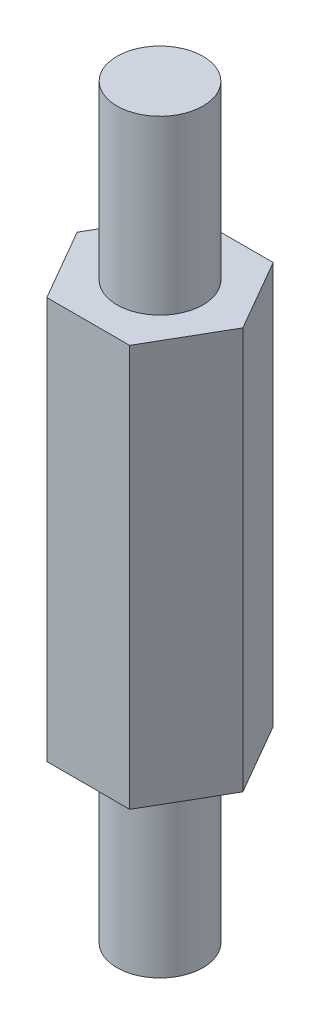
ISO-10303-21;
HEADER;
FILE_DESCRIPTION(('STEP AP214'),'2;1');
FILE_NAME('part.step','',(''),(''),'','','');
FILE_SCHEMA(('AUTOMOTIVE_DESIGN { 1 0 10303 214 1 1 1 1 }'));
ENDSEC;
DATA;
#1=APPLICATION_CONTEXT('core data for automotive mechanical design processes');
#2=APPLICATION_PROTOCOL_DEFINITION('international standard','automotive_design',2000,#1);
#3=PRODUCT_CONTEXT('',#1,'mechanical');
#4=PRODUCT('Part','Part','',(#3));
#5=PRODUCT_RELATED_PRODUCT_CATEGORY('part','',(#4));
#6=PRODUCT_DEFINITION_FORMATION('','',#4);
#7=PRODUCT_DEFINITION_CONTEXT('part definition',#1,'design');
#8=PRODUCT_DEFINITION('design','',#6,#7);
#9=PRODUCT_DEFINITION_SHAPE('','',#8);
#10=(LENGTH_UNIT() NAMED_UNIT(*) SI_UNIT(.MILLI.,.METRE.));
#11=(NAMED_UNIT(*) PLANE_ANGLE_UNIT() SI_UNIT($,.RADIAN.));
#12=(NAMED_UNIT(*) SI_UNIT($,.STERADIAN.) SOLID_ANGLE_UNIT());
#13=UNCERTAINTY_MEASURE_WITH_UNIT(LENGTH_MEASURE(1.E-05),#10,'distance_accuracy_value','');
#14=(GEOMETRIC_REPRESENTATION_CONTEXT(3) GLOBAL_UNCERTAINTY_ASSIGNED_CONTEXT((#13)) GLOBAL_UNIT_ASSIGNED_CONTEXT((#10,
#11,#12)) REPRESENTATION_CONTEXT('',''));
#15=CARTESIAN_POINT('',(0.,0.,0.));
#16=DIRECTION('',(0.,0.,1.));
#17=DIRECTION('',(1.,0.,0.));
#18=AXIS2_PLACEMENT_3D('',#15,#16,#17);
#19=CARTESIAN_POINT('',(0.,-6.,0.));
#20=DIRECTION('',(0.,-1.,0.));
#21=DIRECTION('',(1.,0.,0.));
#22=AXIS2_PLACEMENT_3D('',#19,#20,#21);
#23=PLANE('',#22);
#24=CARTESIAN_POINT('',(0.,-6.,0.));
#25=DIRECTION('',(0.,-1.,0.));
#26=DIRECTION('',(1.,0.,0.));
#27=AXIS2_PLACEMENT_3D('',#24,#25,#26);
#28=CIRCLE('',#27,1.5);
#29=CARTESIAN_POINT('',(1.5,-6.,0.));
#30=VERTEX_POINT('',#29);
#31=EDGE_CURVE('E19',#30,#30,#28,.F.);
#32=ORIENTED_EDGE('',*,*,#31,.F.);
#33=EDGE_LOOP('',(#32));
#34=FACE_BOUND('',#33,.T.);
#35=ADVANCED_FACE('F16',(#34),#23,.T.);
#36=CARTESIAN_POINT('',(0.,-3.,0.));
#37=DIRECTION('',(0.,-1.,0.));
#38=DIRECTION('',(1.,0.,0.));
#39=AXIS2_PLACEMENT_3D('',#36,#37,#38);
#40=CYLINDRICAL_SURFACE('',#39,1.5);
#41=CARTESIAN_POINT('',(0.,0.,0.));
#42=DIRECTION('',(0.,-1.,0.));
#43=DIRECTION('',(1.,0.,0.));
#44=AXIS2_PLACEMENT_3D('',#41,#42,#43);
#45=CIRCLE('',#44,1.5);
#46=CARTESIAN_POINT('',(1.5,0.,0.));
#47=VERTEX_POINT('',#46);
#48=EDGE_CURVE('E85',#47,#47,#45,.T.);
#49=ORIENTED_EDGE('',*,*,#48,.T.);
#50=EDGE_LOOP('',(#49));
#51=FACE_BOUND('',#50,.T.);
#52=ORIENTED_EDGE('',*,*,#31,.T.);
#53=EDGE_LOOP('',(#52));
#54=FACE_BOUND('',#53,.T.);
#55=ADVANCED_FACE('F104',(#51,#54),#40,.T.);
#56=CARTESIAN_POINT('',(0.,0.,0.));
#57=DIRECTION('',(0.,1.,0.));
#58=DIRECTION('',(0.,0.,1.));
#59=AXIS2_PLACEMENT_3D('',#56,#57,#58);
#60=PLANE('',#59);
#61=ORIENTED_EDGE('',*,*,#48,.F.);
#62=EDGE_LOOP('',(#61));
#63=FACE_BOUND('',#62,.T.);
#64=DIRECTION('',(-0.500000000000001,0.,-0.866025403784438));
#65=VECTOR('',#64,1.);
#66=CARTESIAN_POINT('',(2.88675134594813,0.,0.));
#67=LINE('',#66,#65);
#68=CARTESIAN_POINT('',(2.88675134594813,0.,0.));
#69=VERTEX_POINT('',#68);
#70=CARTESIAN_POINT('',(1.44337567297406,0.,-2.5));
#71=VERTEX_POINT('',#70);
#72=EDGE_CURVE('E242',#69,#71,#67,.T.);
#73=ORIENTED_EDGE('',*,*,#72,.F.);
#74=DIRECTION('',(0.499999999999999,0.,-0.866025403784439));
#75=VECTOR('',#74,1.);
#76=CARTESIAN_POINT('',(1.44337567297407,0.,2.5));
#77=LINE('',#76,#75);
#78=CARTESIAN_POINT('',(1.44337567297407,0.,2.5));
#79=VERTEX_POINT('',#78);
#80=EDGE_CURVE('E247',#79,#69,#77,.T.);
#81=ORIENTED_EDGE('',*,*,#80,.F.);
#82=DIRECTION('',(1.,0.,0.));
#83=VECTOR('',#82,1.);
#84=CARTESIAN_POINT('',(-1.44337567297406,0.,2.5));
#85=LINE('',#84,#83);
#86=CARTESIAN_POINT('',(-1.44337567297406,0.,2.5));
#87=VERTEX_POINT('',#86);
#88=EDGE_CURVE('E250',#87,#79,#85,.T.);
#89=ORIENTED_EDGE('',*,*,#88,.F.);
#90=DIRECTION('',(0.500000000000001,0.,0.866025403784438));
#91=VECTOR('',#90,1.);
#92=CARTESIAN_POINT('',(-2.88675134594813,0.,0.));
#93=LINE('',#92,#91);
#94=CARTESIAN_POINT('',(-2.88675134594813,0.,0.));
#95=VERTEX_POINT('',#94);
#96=EDGE_CURVE('E67',#95,#87,#93,.T.);
#97=ORIENTED_EDGE('',*,*,#96,.F.);
#98=DIRECTION('',(-0.5,0.,0.866025403784439));
#99=VECTOR('',#98,1.);
#100=CARTESIAN_POINT('',(-1.44337567297406,0.,-2.5));
#101=LINE('',#100,#99);
#102=CARTESIAN_POINT('',(-1.44337567297406,0.,-2.5));
#103=VERTEX_POINT('',#102);
#104=EDGE_CURVE('E69',#103,#95,#101,.T.);
#105=ORIENTED_EDGE('',*,*,#104,.F.);
#106=DIRECTION('',(-1.,0.,0.));
#107=VECTOR('',#106,1.);
#108=CARTESIAN_POINT('',(1.44337567297406,0.,-2.5));
#109=LINE('',#108,#107);
#110=EDGE_CURVE('E72',#71,#103,#109,.T.);
#111=ORIENTED_EDGE('',*,*,#110,.F.);
#112=EDGE_LOOP('',(#73,#81,#89,#97,#105,#111));
#113=FACE_BOUND('',#112,.T.);
#114=ADVANCED_FACE('F71',(#63,#113),#60,.F.);
#115=CARTESIAN_POINT('',(1.44337567297406,0.,-2.5));
#116=DIRECTION('',(0.,0.,-1.));
#117=DIRECTION('',(-1.,0.,0.));
#118=AXIS2_PLACEMENT_3D('',#115,#116,#117);
#119=PLANE('',#118);
#120=DIRECTION('',(1.,0.,0.));
#121=VECTOR('',#120,1.);
#122=CARTESIAN_POINT('',(0.,14.,-2.5));
#123=LINE('',#122,#121);
#124=CARTESIAN_POINT('',(1.44337567297406,14.,-2.5));
#125=VERTEX_POINT('',#124);
#126=CARTESIAN_POINT('',(-1.44337567297406,14.,-2.5));
#127=VERTEX_POINT('',#126);
#128=EDGE_CURVE('E235',#125,#127,#123,.F.);
#129=ORIENTED_EDGE('',*,*,#128,.F.);
#130=DIRECTION('',(0.,1.,0.));
#131=VECTOR('',#130,1.);
#132=CARTESIAN_POINT('',(1.44337567297406,0.,-2.5));
#133=LINE('',#132,#131);
#134=EDGE_CURVE('E83',#71,#125,#133,.T.);
#135=ORIENTED_EDGE('',*,*,#134,.F.);
#136=ORIENTED_EDGE('',*,*,#110,.T.);
#137=DIRECTION('',(0.,1.,0.));
#138=VECTOR('',#137,1.);
#139=CARTESIAN_POINT('',(-1.44337567297406,0.,-2.5));
#140=LINE('',#139,#138);
#141=EDGE_CURVE('E77',#127,#103,#140,.F.);
#142=ORIENTED_EDGE('',*,*,#141,.F.);
#143=EDGE_LOOP('',(#129,#135,#136,#142));
#144=FACE_BOUND('',#143,.T.);
#145=ADVANCED_FACE('F80',(#144),#119,.T.);
#146=CARTESIAN_POINT('',(-1.44337567297406,0.,-2.5));
#147=DIRECTION('',(-0.866025403784439,0.,-0.5));
#148=DIRECTION('',(-0.5,0.,0.866025403784439));
#149=AXIS2_PLACEMENT_3D('',#146,#147,#148);
#150=PLANE('',#149);
#151=DIRECTION('',(-0.500000000000001,0.,0.866025403784438));
#152=VECTOR('',#151,1.);
#153=CARTESIAN_POINT('',(-1.44337567297406,14.,-2.5));
#154=LINE('',#153,#152);
#155=CARTESIAN_POINT('',(-2.88675134594813,14.,0.));
#156=VERTEX_POINT('',#155);
#157=EDGE_CURVE('E89',#127,#156,#154,.T.);
#158=ORIENTED_EDGE('',*,*,#157,.F.);
#159=ORIENTED_EDGE('',*,*,#141,.T.);
#160=ORIENTED_EDGE('',*,*,#104,.T.);
#161=DIRECTION('',(0.,1.,0.));
#162=VECTOR('',#161,1.);
#163=CARTESIAN_POINT('',(-2.88675134594813,0.,0.));
#164=LINE('',#163,#162);
#165=EDGE_CURVE('E92',#156,#95,#164,.F.);
#166=ORIENTED_EDGE('',*,*,#165,.F.);
#167=EDGE_LOOP('',(#158,#159,#160,#166));
#168=FACE_BOUND('',#167,.T.);
#169=ADVANCED_FACE('F87',(#168),#150,.T.);
#170=CARTESIAN_POINT('',(-2.88675134594813,0.,0.));
#171=DIRECTION('',(-0.866025403784438,0.,0.500000000000001));
#172=DIRECTION('',(0.500000000000001,0.,0.866025403784438));
#173=AXIS2_PLACEMENT_3D('',#170,#171,#172);
#174=PLANE('',#173);
#175=DIRECTION('',(0.500000000000002,0.,0.866025403784438));
#176=VECTOR('',#175,1.);
#177=CARTESIAN_POINT('',(-2.88675134594813,14.,0.));
#178=LINE('',#177,#176);
#179=CARTESIAN_POINT('',(-1.44337567297406,14.,2.5));
#180=VERTEX_POINT('',#179);
#181=EDGE_CURVE('E225',#156,#180,#178,.T.);
#182=ORIENTED_EDGE('',*,*,#181,.F.);
#183=ORIENTED_EDGE('',*,*,#165,.T.);
#184=ORIENTED_EDGE('',*,*,#96,.T.);
#185=DIRECTION('',(0.,1.,0.));
#186=VECTOR('',#185,1.);
#187=CARTESIAN_POINT('',(-1.44337567297406,0.,2.5));
#188=LINE('',#187,#186);
#189=EDGE_CURVE('E227',#180,#87,#188,.F.);
#190=ORIENTED_EDGE('',*,*,#189,.F.);
#191=EDGE_LOOP('',(#182,#183,#184,#190));
#192=FACE_BOUND('',#191,.T.);
#193=ADVANCED_FACE('F137',(#192),#174,.T.);
#194=CARTESIAN_POINT('',(-1.44337567297406,0.,2.5));
#195=DIRECTION('',(0.,0.,1.));
#196=DIRECTION('',(1.,0.,0.));
#197=AXIS2_PLACEMENT_3D('',#194,#195,#196);
#198=PLANE('',#197);
#199=DIRECTION('',(1.,0.,0.));
#200=VECTOR('',#199,1.);
#201=CARTESIAN_POINT('',(0.,14.,2.5));
#202=LINE('',#201,#200);
#203=CARTESIAN_POINT('',(1.44337567297407,14.,2.5));
#204=VERTEX_POINT('',#203);
#205=EDGE_CURVE('E231',#180,#204,#202,.T.);
#206=ORIENTED_EDGE('',*,*,#205,.F.);
#207=ORIENTED_EDGE('',*,*,#189,.T.);
#208=ORIENTED_EDGE('',*,*,#88,.T.);
#209=DIRECTION('',(0.,1.,0.));
#210=VECTOR('',#209,1.);
#211=CARTESIAN_POINT('',(1.44337567297407,0.,2.5));
#212=LINE('',#211,#210);
#213=EDGE_CURVE('E244',#204,#79,#212,.F.);
#214=ORIENTED_EDGE('',*,*,#213,.F.);
#215=EDGE_LOOP('',(#206,#207,#208,#214));
#216=FACE_BOUND('',#215,.T.);
#217=ADVANCED_FACE('F134',(#216),#198,.T.);
#218=CARTESIAN_POINT('',(1.44337567297407,0.,2.5));
#219=DIRECTION('',(0.866025403784439,0.,0.499999999999999));
#220=DIRECTION('',(0.499999999999999,0.,-0.866025403784439));
#221=AXIS2_PLACEMENT_3D('',#218,#219,#220);
#222=PLANE('',#221);
#223=DIRECTION('',(0.499999999999998,0.,-0.86602540378444));
#224=VECTOR('',#223,1.);
#225=CARTESIAN_POINT('',(1.44337567297407,14.,2.5));
#226=LINE('',#225,#224);
#227=CARTESIAN_POINT('',(2.88675134594813,14.,0.));
#228=VERTEX_POINT('',#227);
#229=EDGE_CURVE('E252',#204,#228,#226,.T.);
#230=ORIENTED_EDGE('',*,*,#229,.F.);
#231=ORIENTED_EDGE('',*,*,#213,.T.);
#232=ORIENTED_EDGE('',*,*,#80,.T.);
#233=DIRECTION('',(0.,1.,0.));
#234=VECTOR('',#233,1.);
#235=CARTESIAN_POINT('',(2.88675134594813,0.,0.));
#236=LINE('',#235,#234);
#237=EDGE_CURVE('E34',#228,#69,#236,.F.);
#238=ORIENTED_EDGE('',*,*,#237,.F.);
#239=EDGE_LOOP('',(#230,#231,#232,#238));
#240=FACE_BOUND('',#239,.T.);
#241=ADVANCED_FACE('F130',(#240),#222,.T.);
#242=CARTESIAN_POINT('',(2.88675134594813,0.,0.));
#243=DIRECTION('',(0.866025403784438,0.,-0.500000000000001));
#244=DIRECTION('',(-0.500000000000001,0.,-0.866025403784438));
#245=AXIS2_PLACEMENT_3D('',#242,#243,#244);
#246=PLANE('',#245);
#247=DIRECTION('',(-0.500000000000002,0.,-0.866025403784438));
#248=VECTOR('',#247,1.);
#249=CARTESIAN_POINT('',(2.88675134594813,14.,0.));
#250=LINE('',#249,#248);
#251=EDGE_CURVE('E97',#228,#125,#250,.T.);
#252=ORIENTED_EDGE('',*,*,#251,.F.);
#253=ORIENTED_EDGE('',*,*,#237,.T.);
#254=ORIENTED_EDGE('',*,*,#72,.T.);
#255=ORIENTED_EDGE('',*,*,#134,.T.);
#256=EDGE_LOOP('',(#252,#253,#254,#255));
#257=FACE_BOUND('',#256,.T.);
#258=ADVANCED_FACE('F126',(#257),#246,.T.);
#259=CARTESIAN_POINT('',(0.,14.,0.));
#260=DIRECTION('',(0.,1.,0.));
#261=DIRECTION('',(0.,0.,1.));
#262=AXIS2_PLACEMENT_3D('',#259,#260,#261);
#263=PLANE('',#262);
#264=CARTESIAN_POINT('',(0.,14.,0.));
#265=DIRECTION('',(0.,-1.,0.));
#266=DIRECTION('',(1.,0.,0.));
#267=AXIS2_PLACEMENT_3D('',#264,#265,#266);
#268=CIRCLE('',#267,1.5);
#269=CARTESIAN_POINT('',(1.5,14.,0.));
#270=VERTEX_POINT('',#269);
#271=EDGE_CURVE('E25',#270,#270,#268,.F.);
#272=ORIENTED_EDGE('',*,*,#271,.F.);
#273=EDGE_LOOP('',(#272));
#274=FACE_BOUND('',#273,.T.);
#275=ORIENTED_EDGE('',*,*,#229,.T.);
#276=ORIENTED_EDGE('',*,*,#251,.T.);
#277=ORIENTED_EDGE('',*,*,#128,.T.);
#278=ORIENTED_EDGE('',*,*,#157,.T.);
#279=ORIENTED_EDGE('',*,*,#181,.T.);
#280=ORIENTED_EDGE('',*,*,#205,.T.);
#281=EDGE_LOOP('',(#275,#276,#277,#278,#279,#280));
#282=FACE_BOUND('',#281,.T.);
#283=ADVANCED_FACE('F119',(#274,#282),#263,.T.);
#284=CARTESIAN_POINT('',(1.5,20.,0.));
#285=DIRECTION('',(0.,1.,0.));
#286=DIRECTION('',(-1.,0.,0.));
#287=AXIS2_PLACEMENT_3D('',#284,#285,#286);
#288=PLANE('',#287);
#289=CARTESIAN_POINT('',(0.,20.,0.));
#290=DIRECTION('',(0.,-1.,0.));
#291=DIRECTION('',(1.,0.,0.));
#292=AXIS2_PLACEMENT_3D('',#289,#290,#291);
#293=CIRCLE('',#292,1.5);
#294=CARTESIAN_POINT('',(1.5,20.,0.));
#295=VERTEX_POINT('',#294);
#296=EDGE_CURVE('E11',#295,#295,#293,.T.);
#297=ORIENTED_EDGE('',*,*,#296,.F.);
#298=EDGE_LOOP('',(#297));
#299=FACE_BOUND('',#298,.T.);
#300=ADVANCED_FACE('F113',(#299),#288,.T.);
#301=CARTESIAN_POINT('',(0.,17.,0.));
#302=DIRECTION('',(0.,-1.,0.));
#303=DIRECTION('',(1.,0.,0.));
#304=AXIS2_PLACEMENT_3D('',#301,#302,#303);
#305=CYLINDRICAL_SURFACE('',#304,1.5);
#306=ORIENTED_EDGE('',*,*,#296,.T.);
#307=EDGE_LOOP('',(#306));
#308=FACE_BOUND('',#307,.T.);
#309=ORIENTED_EDGE('',*,*,#271,.T.);
#310=EDGE_LOOP('',(#309));
#311=FACE_BOUND('',#310,.T.);
#312=ADVANCED_FACE('F111',(#308,#311),#305,.T.);
#313=CLOSED_SHELL('',(#35,#55,#114,#145,#169,#193,#217,#241,#258,#283,#300,#312));
#314=MANIFOLD_SOLID_BREP('B1',#313);
#315=ADVANCED_BREP_SHAPE_REPRESENTATION('',(#18,#314),#14);
#316=SHAPE_DEFINITION_REPRESENTATION(#9,#315);
ENDSEC;
END-ISO-10303-21;
